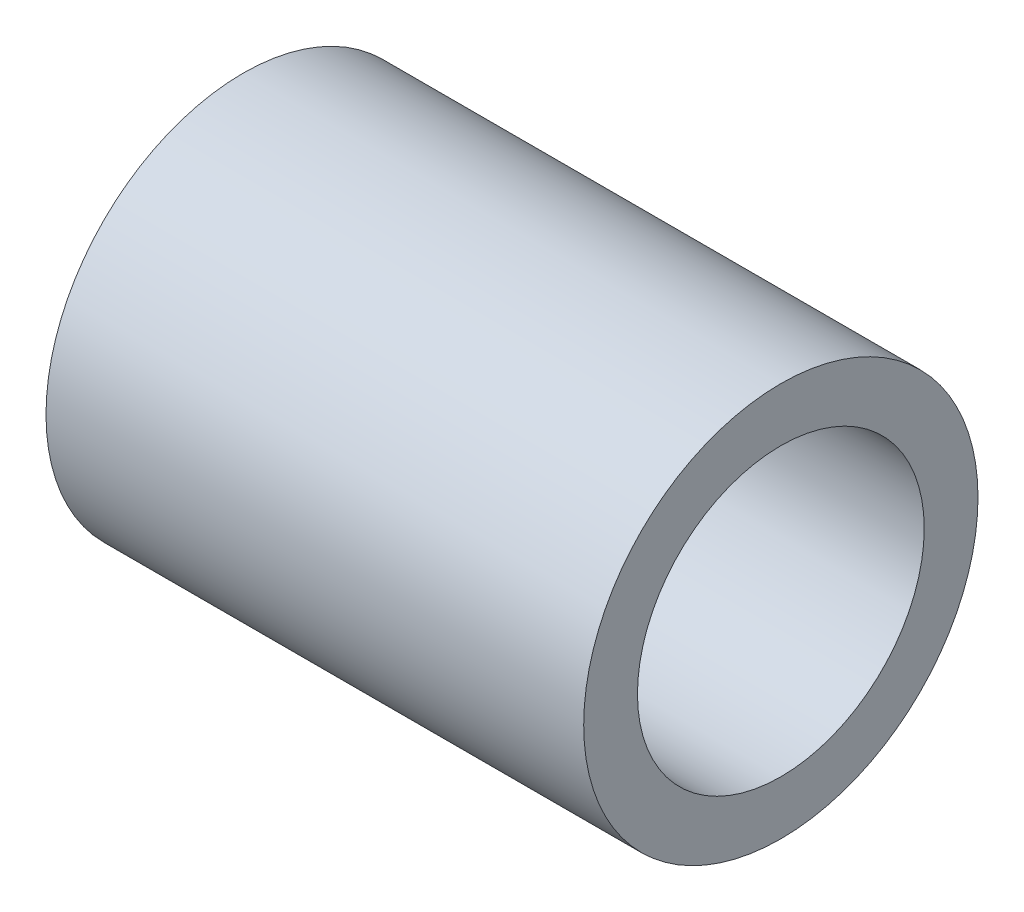
ISO-10303-21;
HEADER;
FILE_DESCRIPTION(('STEP AP214'),'2;1');
FILE_NAME('part.step','',(''),(''),'','','');
FILE_SCHEMA(('AUTOMOTIVE_DESIGN { 1 0 10303 214 1 1 1 1 }'));
ENDSEC;
DATA;
#1=APPLICATION_CONTEXT('core data for automotive mechanical design processes');
#2=APPLICATION_PROTOCOL_DEFINITION('international standard','automotive_design',2000,#1);
#3=PRODUCT_CONTEXT('',#1,'mechanical');
#4=PRODUCT('Part','Part','',(#3));
#5=PRODUCT_RELATED_PRODUCT_CATEGORY('part','',(#4));
#6=PRODUCT_DEFINITION_FORMATION('','',#4);
#7=PRODUCT_DEFINITION_CONTEXT('part definition',#1,'design');
#8=PRODUCT_DEFINITION('design','',#6,#7);
#9=PRODUCT_DEFINITION_SHAPE('','',#8);
#10=(LENGTH_UNIT() NAMED_UNIT(*) SI_UNIT(.MILLI.,.METRE.));
#11=(NAMED_UNIT(*) PLANE_ANGLE_UNIT() SI_UNIT($,.RADIAN.));
#12=(NAMED_UNIT(*) SI_UNIT($,.STERADIAN.) SOLID_ANGLE_UNIT());
#13=UNCERTAINTY_MEASURE_WITH_UNIT(LENGTH_MEASURE(1.E-05),#10,'distance_accuracy_value','');
#14=(GEOMETRIC_REPRESENTATION_CONTEXT(3) GLOBAL_UNCERTAINTY_ASSIGNED_CONTEXT((#13)) GLOBAL_UNIT_ASSIGNED_CONTEXT((#10,
#11,#12)) REPRESENTATION_CONTEXT('',''));
#15=CARTESIAN_POINT('',(0.,0.,0.));
#16=DIRECTION('',(0.,0.,1.));
#17=DIRECTION('',(1.,0.,0.));
#18=AXIS2_PLACEMENT_3D('',#15,#16,#17);
#19=CARTESIAN_POINT('',(-30.,0.,0.));
#20=DIRECTION('',(1.,0.,0.));
#21=DIRECTION('',(0.,0.,-1.));
#22=AXIS2_PLACEMENT_3D('',#19,#20,#21);
#23=CYLINDRICAL_SURFACE('',#22,11.);
#24=CARTESIAN_POINT('',(-30.,0.,0.));
#25=DIRECTION('',(1.,0.,0.));
#26=DIRECTION('',(0.,0.,-1.));
#27=AXIS2_PLACEMENT_3D('',#24,#25,#26);
#28=CIRCLE('',#27,11.);
#29=CARTESIAN_POINT('',(-30.,0.,-11.));
#30=VERTEX_POINT('',#29);
#31=EDGE_CURVE('E10',#30,#30,#28,.T.);
#32=ORIENTED_EDGE('',*,*,#31,.T.);
#33=EDGE_LOOP('',(#32));
#34=FACE_BOUND('',#33,.T.);
#35=CARTESIAN_POINT('',(0.,0.,0.));
#36=DIRECTION('',(1.,0.,0.));
#37=DIRECTION('',(0.,0.,-1.));
#38=AXIS2_PLACEMENT_3D('',#35,#36,#37);
#39=CIRCLE('',#38,11.);
#40=CARTESIAN_POINT('',(0.,0.,-11.));
#41=VERTEX_POINT('',#40);
#42=EDGE_CURVE('E35',#41,#41,#39,.T.);
#43=ORIENTED_EDGE('',*,*,#42,.F.);
#44=EDGE_LOOP('',(#43));
#45=FACE_BOUND('',#44,.T.);
#46=ADVANCED_FACE('F32',(#34,#45),#23,.T.);
#47=CARTESIAN_POINT('',(-30.,0.,0.));
#48=DIRECTION('',(1.,0.,0.));
#49=DIRECTION('',(0.,0.,-1.));
#50=AXIS2_PLACEMENT_3D('',#47,#48,#49);
#51=PLANE('',#50);
#52=CARTESIAN_POINT('',(-30.,0.,0.));
#53=DIRECTION('',(1.,0.,0.));
#54=DIRECTION('',(0.,0.,-1.));
#55=AXIS2_PLACEMENT_3D('',#52,#53,#54);
#56=CIRCLE('',#55,8.);
#57=CARTESIAN_POINT('',(-30.,0.,-8.));
#58=VERTEX_POINT('',#57);
#59=EDGE_CURVE('E42',#58,#58,#56,.T.);
#60=ORIENTED_EDGE('',*,*,#59,.T.);
#61=EDGE_LOOP('',(#60));
#62=FACE_BOUND('',#61,.T.);
#63=ORIENTED_EDGE('',*,*,#31,.F.);
#64=EDGE_LOOP('',(#63));
#65=FACE_BOUND('',#64,.T.);
#66=ADVANCED_FACE('F50',(#62,#65),#51,.F.);
#67=CARTESIAN_POINT('',(0.,0.,0.));
#68=DIRECTION('',(1.,0.,0.));
#69=DIRECTION('',(0.,0.,-1.));
#70=AXIS2_PLACEMENT_3D('',#67,#68,#69);
#71=PLANE('',#70);
#72=CARTESIAN_POINT('',(0.,0.,0.));
#73=DIRECTION('',(1.,0.,0.));
#74=DIRECTION('',(0.,0.,-1.));
#75=AXIS2_PLACEMENT_3D('',#72,#73,#74);
#76=CIRCLE('',#75,8.);
#77=CARTESIAN_POINT('',(0.,0.,-8.));
#78=VERTEX_POINT('',#77);
#79=EDGE_CURVE('E44',#78,#78,#76,.T.);
#80=ORIENTED_EDGE('',*,*,#79,.F.);
#81=EDGE_LOOP('',(#80));
#82=FACE_BOUND('',#81,.T.);
#83=ORIENTED_EDGE('',*,*,#42,.T.);
#84=EDGE_LOOP('',(#83));
#85=FACE_BOUND('',#84,.T.);
#86=ADVANCED_FACE('F56',(#82,#85),#71,.T.);
#87=CARTESIAN_POINT('',(-30.,0.,0.));
#88=DIRECTION('',(1.,0.,0.));
#89=DIRECTION('',(0.,0.,-1.));
#90=AXIS2_PLACEMENT_3D('',#87,#88,#89);
#91=CYLINDRICAL_SURFACE('',#90,8.);
#92=ORIENTED_EDGE('',*,*,#59,.F.);
#93=EDGE_LOOP('',(#92));
#94=FACE_BOUND('',#93,.T.);
#95=ORIENTED_EDGE('',*,*,#79,.T.);
#96=EDGE_LOOP('',(#95));
#97=FACE_BOUND('',#96,.T.);
#98=ADVANCED_FACE('F53',(#94,#97),#91,.F.);
#99=CLOSED_SHELL('',(#46,#66,#86,#98));
#100=MANIFOLD_SOLID_BREP('B2',#99);
#101=ADVANCED_BREP_SHAPE_REPRESENTATION('',(#18,#100),#14);
#102=SHAPE_DEFINITION_REPRESENTATION(#9,#101);
ENDSEC;
END-ISO-10303-21;
